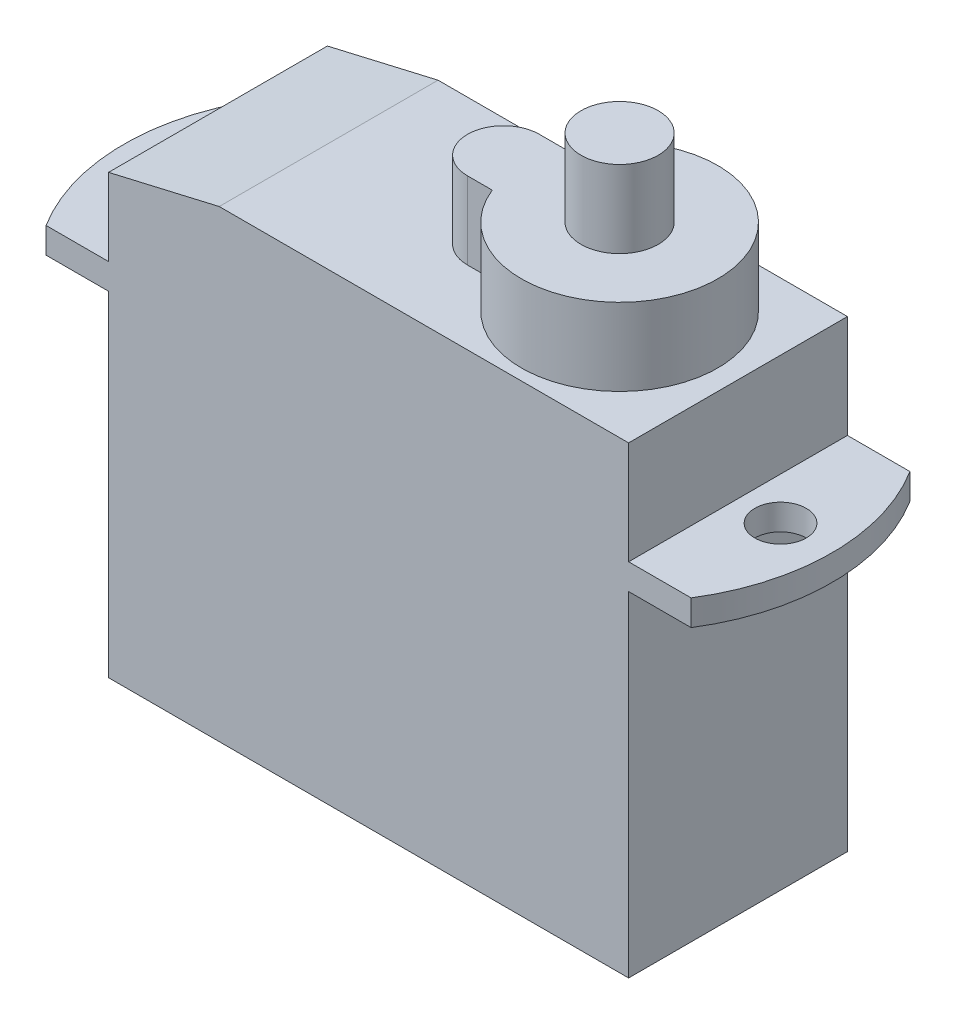
ISO-10303-21;
HEADER;
FILE_DESCRIPTION(('STEP AP214'),'2;1');
FILE_NAME('part.step','',(''),(''),'','','');
FILE_SCHEMA(('AUTOMOTIVE_DESIGN { 1 0 10303 214 1 1 1 1 }'));
ENDSEC;
DATA;
#1=APPLICATION_CONTEXT('core data for automotive mechanical design processes');
#2=APPLICATION_PROTOCOL_DEFINITION('international standard','automotive_design',2000,#1);
#3=PRODUCT_CONTEXT('',#1,'mechanical');
#4=PRODUCT('Part','Part','',(#3));
#5=PRODUCT_RELATED_PRODUCT_CATEGORY('part','',(#4));
#6=PRODUCT_DEFINITION_FORMATION('','',#4);
#7=PRODUCT_DEFINITION_CONTEXT('part definition',#1,'design');
#8=PRODUCT_DEFINITION('design','',#6,#7);
#9=PRODUCT_DEFINITION_SHAPE('','',#8);
#10=(LENGTH_UNIT() NAMED_UNIT(*) SI_UNIT(.MILLI.,.METRE.));
#11=(NAMED_UNIT(*) PLANE_ANGLE_UNIT() SI_UNIT($,.RADIAN.));
#12=(NAMED_UNIT(*) SI_UNIT($,.STERADIAN.) SOLID_ANGLE_UNIT());
#13=UNCERTAINTY_MEASURE_WITH_UNIT(LENGTH_MEASURE(1.E-05),#10,'distance_accuracy_value','');
#14=(GEOMETRIC_REPRESENTATION_CONTEXT(3) GLOBAL_UNCERTAINTY_ASSIGNED_CONTEXT((#13)) GLOBAL_UNIT_ASSIGNED_CONTEXT((#10,
#11,#12)) REPRESENTATION_CONTEXT('',''));
#15=CARTESIAN_POINT('',(0.,0.,0.));
#16=DIRECTION('',(0.,0.,1.));
#17=DIRECTION('',(1.,0.,0.));
#18=AXIS2_PLACEMENT_3D('',#15,#16,#17);
#19=CARTESIAN_POINT('',(5.5002938507475,24.,0.));
#20=DIRECTION('',(0.,1.,0.));
#21=DIRECTION('',(0.,0.,1.));
#22=AXIS2_PLACEMENT_3D('',#19,#20,#21);
#23=PLANE('',#22);
#24=CARTESIAN_POINT('',(5.5002938507475,24.,0.));
#25=DIRECTION('',(0.,-1.,0.));
#26=DIRECTION('',(0.,0.,-1.));
#27=AXIS2_PLACEMENT_3D('',#24,#25,#26);
#28=CIRCLE('',#27,1.5);
#29=CARTESIAN_POINT('',(5.5002938507475,24.,-1.5));
#30=VERTEX_POINT('',#29);
#31=EDGE_CURVE('E20',#30,#30,#28,.T.);
#32=ORIENTED_EDGE('',*,*,#31,.F.);
#33=EDGE_LOOP('',(#32));
#34=FACE_BOUND('',#33,.T.);
#35=ADVANCED_FACE('F17',(#34),#23,.T.);
#36=CARTESIAN_POINT('',(5.5002938507475,24.,0.));
#37=DIRECTION('',(0.,-1.,0.));
#38=DIRECTION('',(0.,0.,-1.));
#39=AXIS2_PLACEMENT_3D('',#36,#37,#38);
#40=CYLINDRICAL_SURFACE('',#39,1.5);
#41=CARTESIAN_POINT('',(5.5002938507475,21.,0.));
#42=DIRECTION('',(0.,-1.,0.));
#43=DIRECTION('',(0.,0.,-1.));
#44=AXIS2_PLACEMENT_3D('',#41,#42,#43);
#45=CIRCLE('',#44,1.5);
#46=CARTESIAN_POINT('',(5.5002938507475,21.,-1.5));
#47=VERTEX_POINT('',#46);
#48=EDGE_CURVE('E149',#47,#47,#45,.T.);
#49=ORIENTED_EDGE('',*,*,#48,.F.);
#50=EDGE_LOOP('',(#49));
#51=FACE_BOUND('',#50,.T.);
#52=ORIENTED_EDGE('',*,*,#31,.T.);
#53=EDGE_LOOP('',(#52));
#54=FACE_BOUND('',#53,.T.);
#55=ADVANCED_FACE('F230',(#51,#54),#40,.T.);
#56=CARTESIAN_POINT('',(0.988334051306182,21.,-1.3965589855414));
#57=DIRECTION('',(0.,0.,1.));
#58=DIRECTION('',(1.,0.,0.));
#59=AXIS2_PLACEMENT_3D('',#56,#57,#58);
#60=PLANE('',#59);
#61=DIRECTION('',(0.,-1.,0.));
#62=VECTOR('',#61,1.);
#63=CARTESIAN_POINT('',(0.988334051306182,21.,-1.3965589855414));
#64=LINE('',#63,#62);
#65=CARTESIAN_POINT('',(0.988334051306182,21.,-1.3965589855414));
#66=VERTEX_POINT('',#65);
#67=CARTESIAN_POINT('',(0.988334051306182,18.,-1.3965589855414));
#68=VERTEX_POINT('',#67);
#69=EDGE_CURVE('E156',#66,#68,#64,.T.);
#70=ORIENTED_EDGE('',*,*,#69,.F.);
#71=DIRECTION('',(1.,0.,0.));
#72=VECTOR('',#71,1.);
#73=CARTESIAN_POINT('',(0.988334051306182,21.,-1.3965589855414));
#74=LINE('',#73,#72);
#75=CARTESIAN_POINT('',(1.95030286475577,21.,-1.3965589855414));
#76=VERTEX_POINT('',#75);
#77=EDGE_CURVE('E140',#76,#66,#74,.F.);
#78=ORIENTED_EDGE('',*,*,#77,.F.);
#79=DIRECTION('',(0.,-1.,0.));
#80=VECTOR('',#79,1.);
#81=CARTESIAN_POINT('',(1.95030286475577,21.,-1.3965589855414));
#82=LINE('',#81,#80);
#83=CARTESIAN_POINT('',(1.95030286475577,18.,-1.3965589855414));
#84=VERTEX_POINT('',#83);
#85=EDGE_CURVE('E162',#84,#76,#82,.F.);
#86=ORIENTED_EDGE('',*,*,#85,.F.);
#87=DIRECTION('',(1.,0.,0.));
#88=VECTOR('',#87,1.);
#89=CARTESIAN_POINT('',(0.988334051306182,18.,-1.3965589855414));
#90=LINE('',#89,#88);
#91=EDGE_CURVE('E150',#68,#84,#90,.T.);
#92=ORIENTED_EDGE('',*,*,#91,.F.);
#93=EDGE_LOOP('',(#70,#78,#86,#92));
#94=FACE_BOUND('',#93,.T.);
#95=ADVANCED_FACE('F160',(#94),#60,.F.);
#96=CARTESIAN_POINT('',(0.988334051306182,21.,0.));
#97=DIRECTION('',(0.,1.,0.));
#98=DIRECTION('',(0.,0.,1.));
#99=AXIS2_PLACEMENT_3D('',#96,#97,#98);
#100=PLANE('',#99);
#101=ORIENTED_EDGE('',*,*,#48,.T.);
#102=EDGE_LOOP('',(#101));
#103=FACE_BOUND('',#102,.T.);
#104=CARTESIAN_POINT('',(5.5002938507475,21.,0.));
#105=DIRECTION('',(0.,-1.,0.));
#106=DIRECTION('',(0.,0.,-1.));
#107=AXIS2_PLACEMENT_3D('',#104,#105,#106);
#108=CIRCLE('',#107,3.81481493662785);
#109=CARTESIAN_POINT('',(1.95030286475577,21.,1.3965589855414));
#110=VERTEX_POINT('',#109);
#111=EDGE_CURVE('E144',#76,#110,#108,.T.);
#112=ORIENTED_EDGE('',*,*,#111,.F.);
#113=ORIENTED_EDGE('',*,*,#77,.T.);
#114=CARTESIAN_POINT('',(0.988334051306182,21.,0.));
#115=DIRECTION('',(0.,-1.,0.));
#116=DIRECTION('',(0.,0.,-1.));
#117=AXIS2_PLACEMENT_3D('',#114,#115,#116);
#118=CIRCLE('',#117,1.3965589855414);
#119=CARTESIAN_POINT('',(0.988334051306182,21.,1.3965589855414));
#120=VERTEX_POINT('',#119);
#121=EDGE_CURVE('E143',#120,#66,#118,.T.);
#122=ORIENTED_EDGE('',*,*,#121,.F.);
#123=DIRECTION('',(-1.,0.,0.));
#124=VECTOR('',#123,1.);
#125=CARTESIAN_POINT('',(0.988334051306182,21.,1.3965589855414));
#126=LINE('',#125,#124);
#127=EDGE_CURVE('E134',#120,#110,#126,.F.);
#128=ORIENTED_EDGE('',*,*,#127,.T.);
#129=EDGE_LOOP('',(#112,#113,#122,#128));
#130=FACE_BOUND('',#129,.T.);
#131=ADVANCED_FACE('F142',(#103,#130),#100,.T.);
#132=CARTESIAN_POINT('',(0.988334051306182,21.,1.3965589855414));
#133=DIRECTION('',(0.,0.,-1.));
#134=DIRECTION('',(-1.,0.,0.));
#135=AXIS2_PLACEMENT_3D('',#132,#133,#134);
#136=PLANE('',#135);
#137=DIRECTION('',(0.,-1.,0.));
#138=VECTOR('',#137,1.);
#139=CARTESIAN_POINT('',(1.95030286475577,21.,1.3965589855414));
#140=LINE('',#139,#138);
#141=CARTESIAN_POINT('',(1.95030286475577,18.,1.3965589855414));
#142=VERTEX_POINT('',#141);
#143=EDGE_CURVE('E225',#110,#142,#140,.T.);
#144=ORIENTED_EDGE('',*,*,#143,.F.);
#145=ORIENTED_EDGE('',*,*,#127,.F.);
#146=DIRECTION('',(0.,-1.,0.));
#147=VECTOR('',#146,1.);
#148=CARTESIAN_POINT('',(0.988334051306182,21.,1.3965589855414));
#149=LINE('',#148,#147);
#150=CARTESIAN_POINT('',(0.988334051306182,18.,1.3965589855414));
#151=VERTEX_POINT('',#150);
#152=EDGE_CURVE('E158',#151,#120,#149,.F.);
#153=ORIENTED_EDGE('',*,*,#152,.F.);
#154=DIRECTION('',(-1.,0.,0.));
#155=VECTOR('',#154,1.);
#156=CARTESIAN_POINT('',(0.988334051306182,18.,1.3965589855414));
#157=LINE('',#156,#155);
#158=EDGE_CURVE('E182',#142,#151,#157,.T.);
#159=ORIENTED_EDGE('',*,*,#158,.F.);
#160=EDGE_LOOP('',(#144,#145,#153,#159));
#161=FACE_BOUND('',#160,.T.);
#162=ADVANCED_FACE('F316',(#161),#136,.F.);
#163=CARTESIAN_POINT('',(-5.75,14.,0.));
#164=DIRECTION('',(0.,-1.,0.));
#165=DIRECTION('',(0.,0.,-1.));
#166=AXIS2_PLACEMENT_3D('',#163,#164,#165);
#167=CYLINDRICAL_SURFACE('',#166,8.);
#168=CARTESIAN_POINT('',(-5.75,14.,0.));
#169=DIRECTION('',(0.,-1.,0.));
#170=DIRECTION('',(0.,0.,-1.));
#171=AXIS2_PLACEMENT_3D('',#168,#169,#170);
#172=CIRCLE('',#171,8.);
#173=CARTESIAN_POINT('',(-12.527720855863,14.,-4.25));
#174=VERTEX_POINT('',#173);
#175=CARTESIAN_POINT('',(-12.527720855863,14.,4.25000000000001));
#176=VERTEX_POINT('',#175);
#177=EDGE_CURVE('E214',#174,#176,#172,.F.);
#178=ORIENTED_EDGE('',*,*,#177,.F.);
#179=DIRECTION('',(0.,1.,0.));
#180=VECTOR('',#179,1.);
#181=CARTESIAN_POINT('',(-12.527720855863,13.,-4.25));
#182=LINE('',#181,#180);
#183=CARTESIAN_POINT('',(-12.527720855863,13.,-4.25));
#184=VERTEX_POINT('',#183);
#185=EDGE_CURVE('E183',#174,#184,#182,.F.);
#186=ORIENTED_EDGE('',*,*,#185,.T.);
#187=CARTESIAN_POINT('',(-5.75,13.,0.));
#188=DIRECTION('',(0.,-1.,0.));
#189=DIRECTION('',(0.,0.,-1.));
#190=AXIS2_PLACEMENT_3D('',#187,#188,#189);
#191=CIRCLE('',#190,8.);
#192=CARTESIAN_POINT('',(-12.527720855863,13.,4.25000000000001));
#193=VERTEX_POINT('',#192);
#194=EDGE_CURVE('E218',#184,#193,#191,.F.);
#195=ORIENTED_EDGE('',*,*,#194,.T.);
#196=DIRECTION('',(0.,-1.,0.));
#197=VECTOR('',#196,1.);
#198=CARTESIAN_POINT('',(-12.527720855863,14.,4.25000000000001));
#199=LINE('',#198,#197);
#200=EDGE_CURVE('E168',#193,#176,#199,.F.);
#201=ORIENTED_EDGE('',*,*,#200,.T.);
#202=EDGE_LOOP('',(#178,#186,#195,#201));
#203=FACE_BOUND('',#202,.T.);
#204=ADVANCED_FACE('F312',(#203),#167,.T.);
#205=CARTESIAN_POINT('',(-11.75,14.,0.));
#206=DIRECTION('',(0.,-1.,0.));
#207=DIRECTION('',(0.,0.,-1.));
#208=AXIS2_PLACEMENT_3D('',#205,#206,#207);
#209=CYLINDRICAL_SURFACE('',#208,1.);
#210=CARTESIAN_POINT('',(-11.75,14.,0.));
#211=DIRECTION('',(0.,-1.,0.));
#212=DIRECTION('',(0.,0.,-1.));
#213=AXIS2_PLACEMENT_3D('',#210,#211,#212);
#214=CIRCLE('',#213,1.);
#215=CARTESIAN_POINT('',(-11.75,14.,-1.));
#216=VERTEX_POINT('',#215);
#217=EDGE_CURVE('E178',#216,#216,#214,.T.);
#218=ORIENTED_EDGE('',*,*,#217,.F.);
#219=EDGE_LOOP('',(#218));
#220=FACE_BOUND('',#219,.T.);
#221=CARTESIAN_POINT('',(-11.75,13.,0.));
#222=DIRECTION('',(0.,-1.,0.));
#223=DIRECTION('',(0.,0.,-1.));
#224=AXIS2_PLACEMENT_3D('',#221,#222,#223);
#225=CIRCLE('',#224,1.);
#226=CARTESIAN_POINT('',(-11.75,13.,-1.));
#227=VERTEX_POINT('',#226);
#228=EDGE_CURVE('E222',#227,#227,#225,.T.);
#229=ORIENTED_EDGE('',*,*,#228,.T.);
#230=EDGE_LOOP('',(#229));
#231=FACE_BOUND('',#230,.T.);
#232=ADVANCED_FACE('F309',(#220,#231),#209,.F.);
#233=CARTESIAN_POINT('',(0.988334051306182,21.,0.));
#234=DIRECTION('',(0.,-1.,0.));
#235=DIRECTION('',(0.,0.,-1.));
#236=AXIS2_PLACEMENT_3D('',#233,#234,#235);
#237=CYLINDRICAL_SURFACE('',#236,1.3965589855414);
#238=ORIENTED_EDGE('',*,*,#121,.T.);
#239=ORIENTED_EDGE('',*,*,#69,.T.);
#240=CARTESIAN_POINT('',(0.988334051306182,18.,0.));
#241=DIRECTION('',(0.,-1.,0.));
#242=DIRECTION('',(0.,0.,-1.));
#243=AXIS2_PLACEMENT_3D('',#240,#241,#242);
#244=CIRCLE('',#243,1.3965589855414);
#245=EDGE_CURVE('E209',#151,#68,#244,.T.);
#246=ORIENTED_EDGE('',*,*,#245,.F.);
#247=ORIENTED_EDGE('',*,*,#152,.T.);
#248=EDGE_LOOP('',(#238,#239,#246,#247));
#249=FACE_BOUND('',#248,.T.);
#250=ADVANCED_FACE('F154',(#249),#237,.T.);
#251=CARTESIAN_POINT('',(5.5002938507475,21.,0.));
#252=DIRECTION('',(0.,-1.,0.));
#253=DIRECTION('',(0.,0.,-1.));
#254=AXIS2_PLACEMENT_3D('',#251,#252,#253);
#255=CYLINDRICAL_SURFACE('',#254,3.81481493662785);
#256=ORIENTED_EDGE('',*,*,#143,.T.);
#257=CARTESIAN_POINT('',(5.5002938507475,18.,0.));
#258=DIRECTION('',(0.,-1.,0.));
#259=DIRECTION('',(0.,0.,-1.));
#260=AXIS2_PLACEMENT_3D('',#257,#258,#259);
#261=CIRCLE('',#260,3.81481493662785);
#262=EDGE_CURVE('E205',#84,#142,#261,.T.);
#263=ORIENTED_EDGE('',*,*,#262,.F.);
#264=ORIENTED_EDGE('',*,*,#85,.T.);
#265=ORIENTED_EDGE('',*,*,#111,.T.);
#266=EDGE_LOOP('',(#256,#263,#264,#265));
#267=FACE_BOUND('',#266,.T.);
#268=ADVANCED_FACE('F302',(#267),#255,.T.);
#269=CARTESIAN_POINT('',(11.75,14.,0.));
#270=DIRECTION('',(0.,-1.,0.));
#271=DIRECTION('',(0.,0.,-1.));
#272=AXIS2_PLACEMENT_3D('',#269,#270,#271);
#273=CYLINDRICAL_SURFACE('',#272,1.);
#274=CARTESIAN_POINT('',(11.75,13.,0.));
#275=DIRECTION('',(0.,-1.,0.));
#276=DIRECTION('',(0.,0.,-1.));
#277=AXIS2_PLACEMENT_3D('',#274,#275,#276);
#278=CIRCLE('',#277,1.);
#279=CARTESIAN_POINT('',(11.75,13.,-1.));
#280=VERTEX_POINT('',#279);
#281=EDGE_CURVE('E195',#280,#280,#278,.T.);
#282=ORIENTED_EDGE('',*,*,#281,.T.);
#283=EDGE_LOOP('',(#282));
#284=FACE_BOUND('',#283,.T.);
#285=CARTESIAN_POINT('',(11.75,14.,0.));
#286=DIRECTION('',(0.,-1.,0.));
#287=DIRECTION('',(0.,0.,-1.));
#288=AXIS2_PLACEMENT_3D('',#285,#286,#287);
#289=CIRCLE('',#288,1.);
#290=CARTESIAN_POINT('',(11.75,14.,-1.));
#291=VERTEX_POINT('',#290);
#292=EDGE_CURVE('E198',#291,#291,#289,.T.);
#293=ORIENTED_EDGE('',*,*,#292,.F.);
#294=EDGE_LOOP('',(#293));
#295=FACE_BOUND('',#294,.T.);
#296=ADVANCED_FACE('F298',(#284,#295),#273,.F.);
#297=CARTESIAN_POINT('',(5.75,14.,0.));
#298=DIRECTION('',(0.,-1.,0.));
#299=DIRECTION('',(0.,0.,-1.));
#300=AXIS2_PLACEMENT_3D('',#297,#298,#299);
#301=CYLINDRICAL_SURFACE('',#300,8.);
#302=CARTESIAN_POINT('',(5.75,14.,0.));
#303=DIRECTION('',(0.,-1.,0.));
#304=DIRECTION('',(0.,0.,-1.));
#305=AXIS2_PLACEMENT_3D('',#302,#303,#304);
#306=CIRCLE('',#305,8.);
#307=CARTESIAN_POINT('',(12.527720855863,14.,4.25));
#308=VERTEX_POINT('',#307);
#309=CARTESIAN_POINT('',(12.527720855863,14.,-4.24999999999999));
#310=VERTEX_POINT('',#309);
#311=EDGE_CURVE('E202',#308,#310,#306,.F.);
#312=ORIENTED_EDGE('',*,*,#311,.F.);
#313=DIRECTION('',(0.,-1.,0.));
#314=VECTOR('',#313,1.);
#315=CARTESIAN_POINT('',(12.527720855863,14.,4.25));
#316=LINE('',#315,#314);
#317=CARTESIAN_POINT('',(12.527720855863,13.,4.25));
#318=VERTEX_POINT('',#317);
#319=EDGE_CURVE('E471',#308,#318,#316,.T.);
#320=ORIENTED_EDGE('',*,*,#319,.T.);
#321=CARTESIAN_POINT('',(5.75,13.,0.));
#322=DIRECTION('',(0.,-1.,0.));
#323=DIRECTION('',(0.,0.,-1.));
#324=AXIS2_PLACEMENT_3D('',#321,#322,#323);
#325=CIRCLE('',#324,8.);
#326=CARTESIAN_POINT('',(12.527720855863,13.,-4.24999999999999));
#327=VERTEX_POINT('',#326);
#328=EDGE_CURVE('E191',#318,#327,#325,.F.);
#329=ORIENTED_EDGE('',*,*,#328,.T.);
#330=DIRECTION('',(0.,1.,0.));
#331=VECTOR('',#330,1.);
#332=CARTESIAN_POINT('',(12.527720855863,13.,-4.25));
#333=LINE('',#332,#331);
#334=EDGE_CURVE('E187',#327,#310,#333,.T.);
#335=ORIENTED_EDGE('',*,*,#334,.T.);
#336=EDGE_LOOP('',(#312,#320,#329,#335));
#337=FACE_BOUND('',#336,.T.);
#338=ADVANCED_FACE('F294',(#337),#301,.T.);
#339=CARTESIAN_POINT('',(-10.1,13.,-4.25));
#340=DIRECTION('',(0.,0.,1.));
#341=DIRECTION('',(1.,0.,0.));
#342=AXIS2_PLACEMENT_3D('',#339,#340,#341);
#343=PLANE('',#342);
#344=DIRECTION('',(0.,1.,0.));
#345=VECTOR('',#344,1.);
#346=CARTESIAN_POINT('',(-10.1,13.,-4.25));
#347=LINE('',#346,#345);
#348=CARTESIAN_POINT('',(-10.1,0.,-4.25));
#349=VERTEX_POINT('',#348);
#350=CARTESIAN_POINT('',(-10.1,13.,-4.25));
#351=VERTEX_POINT('',#350);
#352=EDGE_CURVE('E186',#349,#351,#347,.T.);
#353=ORIENTED_EDGE('',*,*,#352,.T.);
#354=DIRECTION('',(1.,0.,0.));
#355=VECTOR('',#354,1.);
#356=CARTESIAN_POINT('',(-5.75,13.,-4.25));
#357=LINE('',#356,#355);
#358=EDGE_CURVE('E513',#351,#184,#357,.F.);
#359=ORIENTED_EDGE('',*,*,#358,.T.);
#360=ORIENTED_EDGE('',*,*,#185,.F.);
#361=DIRECTION('',(1.,0.,0.));
#362=VECTOR('',#361,1.);
#363=CARTESIAN_POINT('',(-5.75,14.,-4.25));
#364=LINE('',#363,#362);
#365=CARTESIAN_POINT('',(-10.1,14.,-4.25));
#366=VERTEX_POINT('',#365);
#367=EDGE_CURVE('E217',#366,#174,#364,.F.);
#368=ORIENTED_EDGE('',*,*,#367,.F.);
#369=DIRECTION('',(0.,1.,0.));
#370=VECTOR('',#369,1.);
#371=CARTESIAN_POINT('',(-10.1,17.,-4.25));
#372=LINE('',#371,#370);
#373=CARTESIAN_POINT('',(-10.1,17.,-4.25));
#374=VERTEX_POINT('',#373);
#375=EDGE_CURVE('E175',#366,#374,#372,.T.);
#376=ORIENTED_EDGE('',*,*,#375,.T.);
#377=DIRECTION('',(-0.973995340832267,-0.226568038427833,0.));
#378=VECTOR('',#377,1.);
#379=CARTESIAN_POINT('',(-10.1,17.,-4.25));
#380=LINE('',#379,#378);
#381=CARTESIAN_POINT('',(-5.80109117071026,18.,-4.25));
#382=VERTEX_POINT('',#381);
#383=EDGE_CURVE('E169',#382,#374,#380,.T.);
#384=ORIENTED_EDGE('',*,*,#383,.F.);
#385=DIRECTION('',(1.,0.,0.));
#386=VECTOR('',#385,1.);
#387=CARTESIAN_POINT('',(-5.80109117071026,18.,-4.25));
#388=LINE('',#387,#386);
#389=CARTESIAN_POINT('',(10.1,18.,-4.25));
#390=VERTEX_POINT('',#389);
#391=EDGE_CURVE('E476',#390,#382,#388,.F.);
#392=ORIENTED_EDGE('',*,*,#391,.F.);
#393=DIRECTION('',(0.,1.,0.));
#394=VECTOR('',#393,1.);
#395=CARTESIAN_POINT('',(10.1,17.,-4.25));
#396=LINE('',#395,#394);
#397=CARTESIAN_POINT('',(10.1,14.,-4.24999999999999));
#398=VERTEX_POINT('',#397);
#399=EDGE_CURVE('E480',#390,#398,#396,.F.);
#400=ORIENTED_EDGE('',*,*,#399,.T.);
#401=DIRECTION('',(1.,0.,0.));
#402=VECTOR('',#401,1.);
#403=CARTESIAN_POINT('',(-5.75,14.,-4.24999999999999));
#404=LINE('',#403,#402);
#405=EDGE_CURVE('E201',#310,#398,#404,.F.);
#406=ORIENTED_EDGE('',*,*,#405,.F.);
#407=ORIENTED_EDGE('',*,*,#334,.F.);
#408=DIRECTION('',(1.,0.,0.));
#409=VECTOR('',#408,1.);
#410=CARTESIAN_POINT('',(-5.75,13.,-4.24999999999999));
#411=LINE('',#410,#409);
#412=CARTESIAN_POINT('',(10.1,13.,-4.25));
#413=VERTEX_POINT('',#412);
#414=EDGE_CURVE('E194',#327,#413,#411,.F.);
#415=ORIENTED_EDGE('',*,*,#414,.T.);
#416=DIRECTION('',(0.,1.,0.));
#417=VECTOR('',#416,1.);
#418=CARTESIAN_POINT('',(10.1,13.,-4.25));
#419=LINE('',#418,#417);
#420=CARTESIAN_POINT('',(10.1,0.,-4.25));
#421=VERTEX_POINT('',#420);
#422=EDGE_CURVE('E486',#413,#421,#419,.F.);
#423=ORIENTED_EDGE('',*,*,#422,.T.);
#424=DIRECTION('',(1.,0.,0.));
#425=VECTOR('',#424,1.);
#426=CARTESIAN_POINT('',(0.,0.,-4.25));
#427=LINE('',#426,#425);
#428=EDGE_CURVE('E491',#349,#421,#427,.T.);
#429=ORIENTED_EDGE('',*,*,#428,.F.);
#430=EDGE_LOOP('',(#353,#359,#360,#368,#376,#384,#392,#400,#406,#407,#415,#423,#429));
#431=FACE_BOUND('',#430,.T.);
#432=ADVANCED_FACE('F290',(#431),#343,.F.);
#433=CARTESIAN_POINT('',(-10.1,13.,4.25));
#434=DIRECTION('',(1.,0.,0.));
#435=DIRECTION('',(0.,0.,-1.));
#436=AXIS2_PLACEMENT_3D('',#433,#434,#435);
#437=PLANE('',#436);
#438=DIRECTION('',(0.,1.,0.));
#439=VECTOR('',#438,1.);
#440=CARTESIAN_POINT('',(-10.1,13.,4.25));
#441=LINE('',#440,#439);
#442=CARTESIAN_POINT('',(-10.1,0.,4.25));
#443=VERTEX_POINT('',#442);
#444=CARTESIAN_POINT('',(-10.1,13.,4.25));
#445=VERTEX_POINT('',#444);
#446=EDGE_CURVE('E493',#443,#445,#441,.T.);
#447=ORIENTED_EDGE('',*,*,#446,.T.);
#448=DIRECTION('',(0.,0.,1.));
#449=VECTOR('',#448,1.);
#450=CARTESIAN_POINT('',(-10.1,13.,0.));
#451=LINE('',#450,#449);
#452=EDGE_CURVE('E221',#445,#351,#451,.F.);
#453=ORIENTED_EDGE('',*,*,#452,.T.);
#454=ORIENTED_EDGE('',*,*,#352,.F.);
#455=DIRECTION('',(0.,0.,-1.));
#456=VECTOR('',#455,1.);
#457=CARTESIAN_POINT('',(-10.1,0.,0.));
#458=LINE('',#457,#456);
#459=EDGE_CURVE('E494',#443,#349,#458,.T.);
#460=ORIENTED_EDGE('',*,*,#459,.F.);
#461=EDGE_LOOP('',(#447,#453,#454,#460));
#462=FACE_BOUND('',#461,.T.);
#463=ADVANCED_FACE('F286',(#462),#437,.F.);
#464=CARTESIAN_POINT('',(-5.75,13.,0.));
#465=DIRECTION('',(0.,1.,0.));
#466=DIRECTION('',(0.,0.,1.));
#467=AXIS2_PLACEMENT_3D('',#464,#465,#466);
#468=PLANE('',#467);
#469=ORIENTED_EDGE('',*,*,#452,.F.);
#470=DIRECTION('',(-1.,0.,0.));
#471=VECTOR('',#470,1.);
#472=CARTESIAN_POINT('',(-10.1,13.,4.25));
#473=LINE('',#472,#471);
#474=EDGE_CURVE('E508',#445,#193,#473,.T.);
#475=ORIENTED_EDGE('',*,*,#474,.T.);
#476=ORIENTED_EDGE('',*,*,#194,.F.);
#477=ORIENTED_EDGE('',*,*,#358,.F.);
#478=EDGE_LOOP('',(#469,#475,#476,#477));
#479=FACE_BOUND('',#478,.T.);
#480=ORIENTED_EDGE('',*,*,#228,.F.);
#481=EDGE_LOOP('',(#480));
#482=FACE_BOUND('',#481,.T.);
#483=ADVANCED_FACE('F282',(#479,#482),#468,.F.);
#484=CARTESIAN_POINT('',(-5.75,14.,0.));
#485=DIRECTION('',(0.,1.,0.));
#486=DIRECTION('',(0.,0.,1.));
#487=AXIS2_PLACEMENT_3D('',#484,#485,#486);
#488=PLANE('',#487);
#489=ORIENTED_EDGE('',*,*,#217,.T.);
#490=EDGE_LOOP('',(#489));
#491=FACE_BOUND('',#490,.T.);
#492=ORIENTED_EDGE('',*,*,#177,.T.);
#493=DIRECTION('',(-1.,0.,0.));
#494=VECTOR('',#493,1.);
#495=CARTESIAN_POINT('',(-10.1,14.,4.25));
#496=LINE('',#495,#494);
#497=CARTESIAN_POINT('',(-10.1,14.,4.25));
#498=VERTEX_POINT('',#497);
#499=EDGE_CURVE('E518',#176,#498,#496,.F.);
#500=ORIENTED_EDGE('',*,*,#499,.T.);
#501=DIRECTION('',(0.,0.,-1.));
#502=VECTOR('',#501,1.);
#503=CARTESIAN_POINT('',(-10.1,14.,-4.25));
#504=LINE('',#503,#502);
#505=EDGE_CURVE('E172',#498,#366,#504,.T.);
#506=ORIENTED_EDGE('',*,*,#505,.T.);
#507=ORIENTED_EDGE('',*,*,#367,.T.);
#508=EDGE_LOOP('',(#492,#500,#506,#507));
#509=FACE_BOUND('',#508,.T.);
#510=ADVANCED_FACE('F278',(#491,#509),#488,.T.);
#511=CARTESIAN_POINT('',(-10.1,17.,-4.25));
#512=DIRECTION('',(1.,0.,0.));
#513=DIRECTION('',(0.,0.,-1.));
#514=AXIS2_PLACEMENT_3D('',#511,#512,#513);
#515=PLANE('',#514);
#516=DIRECTION('',(0.,1.,0.));
#517=VECTOR('',#516,1.);
#518=CARTESIAN_POINT('',(-10.1,13.,4.25));
#519=LINE('',#518,#517);
#520=CARTESIAN_POINT('',(-10.1,17.,4.25));
#521=VERTEX_POINT('',#520);
#522=EDGE_CURVE('E531',#498,#521,#519,.T.);
#523=ORIENTED_EDGE('',*,*,#522,.T.);
#524=DIRECTION('',(0.,0.,1.));
#525=VECTOR('',#524,1.);
#526=CARTESIAN_POINT('',(-10.1,17.,-24.4747373283314));
#527=LINE('',#526,#525);
#528=EDGE_CURVE('E171',#374,#521,#527,.T.);
#529=ORIENTED_EDGE('',*,*,#528,.F.);
#530=ORIENTED_EDGE('',*,*,#375,.F.);
#531=ORIENTED_EDGE('',*,*,#505,.F.);
#532=EDGE_LOOP('',(#523,#529,#530,#531));
#533=FACE_BOUND('',#532,.T.);
#534=ADVANCED_FACE('F274',(#533),#515,.F.);
#535=CARTESIAN_POINT('',(-10.1,17.,-24.4747373283314));
#536=DIRECTION('',(-0.226568038427833,0.973995340832267,0.));
#537=DIRECTION('',(-0.973995340832267,-0.226568038427833,0.));
#538=AXIS2_PLACEMENT_3D('',#535,#536,#537);
#539=PLANE('',#538);
#540=DIRECTION('',(0.973995340832267,0.226568038427834,0.));
#541=VECTOR('',#540,1.);
#542=CARTESIAN_POINT('',(-10.1,17.,4.25));
#543=LINE('',#542,#541);
#544=CARTESIAN_POINT('',(-5.80109117071026,18.,4.25));
#545=VERTEX_POINT('',#544);
#546=EDGE_CURVE('E540',#521,#545,#543,.T.);
#547=ORIENTED_EDGE('',*,*,#546,.T.);
#548=DIRECTION('',(0.,0.,1.));
#549=VECTOR('',#548,1.);
#550=CARTESIAN_POINT('',(-5.80109117071026,18.,-24.4747373283314));
#551=LINE('',#550,#549);
#552=EDGE_CURVE('E211',#382,#545,#551,.T.);
#553=ORIENTED_EDGE('',*,*,#552,.F.);
#554=ORIENTED_EDGE('',*,*,#383,.T.);
#555=ORIENTED_EDGE('',*,*,#528,.T.);
#556=EDGE_LOOP('',(#547,#553,#554,#555));
#557=FACE_BOUND('',#556,.T.);
#558=ADVANCED_FACE('F270',(#557),#539,.T.);
#559=CARTESIAN_POINT('',(-5.80109117071026,18.,-24.4747373283314));
#560=DIRECTION('',(0.,1.,0.));
#561=DIRECTION('',(0.,0.,1.));
#562=AXIS2_PLACEMENT_3D('',#559,#560,#561);
#563=PLANE('',#562);
#564=ORIENTED_EDGE('',*,*,#91,.T.);
#565=ORIENTED_EDGE('',*,*,#262,.T.);
#566=ORIENTED_EDGE('',*,*,#158,.T.);
#567=ORIENTED_EDGE('',*,*,#245,.T.);
#568=EDGE_LOOP('',(#564,#565,#566,#567));
#569=FACE_BOUND('',#568,.T.);
#570=DIRECTION('',(-1.,0.,0.));
#571=VECTOR('',#570,1.);
#572=CARTESIAN_POINT('',(-10.1,18.,4.25));
#573=LINE('',#572,#571);
#574=CARTESIAN_POINT('',(10.1,18.,4.25));
#575=VERTEX_POINT('',#574);
#576=EDGE_CURVE('E548',#545,#575,#573,.F.);
#577=ORIENTED_EDGE('',*,*,#576,.T.);
#578=DIRECTION('',(0.,0.,1.));
#579=VECTOR('',#578,1.);
#580=CARTESIAN_POINT('',(10.1,18.,-4.25));
#581=LINE('',#580,#579);
#582=EDGE_CURVE('E208',#575,#390,#581,.F.);
#583=ORIENTED_EDGE('',*,*,#582,.T.);
#584=ORIENTED_EDGE('',*,*,#391,.T.);
#585=ORIENTED_EDGE('',*,*,#552,.T.);
#586=EDGE_LOOP('',(#577,#583,#584,#585));
#587=FACE_BOUND('',#586,.T.);
#588=ADVANCED_FACE('F266',(#569,#587),#563,.T.);
#589=CARTESIAN_POINT('',(10.1,17.,-4.25));
#590=DIRECTION('',(-1.,0.,0.));
#591=DIRECTION('',(0.,0.,1.));
#592=AXIS2_PLACEMENT_3D('',#589,#590,#591);
#593=PLANE('',#592);
#594=ORIENTED_EDGE('',*,*,#399,.F.);
#595=ORIENTED_EDGE('',*,*,#582,.F.);
#596=DIRECTION('',(0.,1.,0.));
#597=VECTOR('',#596,1.);
#598=CARTESIAN_POINT('',(10.1,13.,4.25));
#599=LINE('',#598,#597);
#600=CARTESIAN_POINT('',(10.1,14.,4.25));
#601=VERTEX_POINT('',#600);
#602=EDGE_CURVE('E556',#575,#601,#599,.F.);
#603=ORIENTED_EDGE('',*,*,#602,.T.);
#604=DIRECTION('',(0.,0.,1.));
#605=VECTOR('',#604,1.);
#606=CARTESIAN_POINT('',(10.1,14.,0.));
#607=LINE('',#606,#605);
#608=EDGE_CURVE('E204',#398,#601,#607,.T.);
#609=ORIENTED_EDGE('',*,*,#608,.F.);
#610=EDGE_LOOP('',(#594,#595,#603,#609));
#611=FACE_BOUND('',#610,.T.);
#612=ADVANCED_FACE('F262',(#611),#593,.F.);
#613=CARTESIAN_POINT('',(-5.75,14.,0.));
#614=DIRECTION('',(0.,1.,0.));
#615=DIRECTION('',(0.,0.,1.));
#616=AXIS2_PLACEMENT_3D('',#613,#614,#615);
#617=PLANE('',#616);
#618=ORIENTED_EDGE('',*,*,#292,.T.);
#619=EDGE_LOOP('',(#618));
#620=FACE_BOUND('',#619,.T.);
#621=ORIENTED_EDGE('',*,*,#311,.T.);
#622=ORIENTED_EDGE('',*,*,#405,.T.);
#623=ORIENTED_EDGE('',*,*,#608,.T.);
#624=DIRECTION('',(-1.,0.,0.));
#625=VECTOR('',#624,1.);
#626=CARTESIAN_POINT('',(-10.1,14.,4.25));
#627=LINE('',#626,#625);
#628=EDGE_CURVE('E565',#601,#308,#627,.F.);
#629=ORIENTED_EDGE('',*,*,#628,.T.);
#630=EDGE_LOOP('',(#621,#622,#623,#629));
#631=FACE_BOUND('',#630,.T.);
#632=ADVANCED_FACE('F258',(#620,#631),#617,.T.);
#633=CARTESIAN_POINT('',(-5.75,13.,0.));
#634=DIRECTION('',(0.,1.,0.));
#635=DIRECTION('',(0.,0.,1.));
#636=AXIS2_PLACEMENT_3D('',#633,#634,#635);
#637=PLANE('',#636);
#638=DIRECTION('',(0.,0.,1.));
#639=VECTOR('',#638,1.);
#640=CARTESIAN_POINT('',(10.1,13.,4.25));
#641=LINE('',#640,#639);
#642=CARTESIAN_POINT('',(10.1,13.,4.25));
#643=VERTEX_POINT('',#642);
#644=EDGE_CURVE('E488',#643,#413,#641,.F.);
#645=ORIENTED_EDGE('',*,*,#644,.T.);
#646=ORIENTED_EDGE('',*,*,#414,.F.);
#647=ORIENTED_EDGE('',*,*,#328,.F.);
#648=DIRECTION('',(-1.,0.,0.));
#649=VECTOR('',#648,1.);
#650=CARTESIAN_POINT('',(-10.1,13.,4.25));
#651=LINE('',#650,#649);
#652=EDGE_CURVE('E573',#318,#643,#651,.T.);
#653=ORIENTED_EDGE('',*,*,#652,.T.);
#654=EDGE_LOOP('',(#645,#646,#647,#653));
#655=FACE_BOUND('',#654,.T.);
#656=ORIENTED_EDGE('',*,*,#281,.F.);
#657=EDGE_LOOP('',(#656));
#658=FACE_BOUND('',#657,.T.);
#659=ADVANCED_FACE('F254',(#655,#658),#637,.F.);
#660=CARTESIAN_POINT('',(10.1,13.,4.25));
#661=DIRECTION('',(-1.,0.,0.));
#662=DIRECTION('',(0.,0.,1.));
#663=AXIS2_PLACEMENT_3D('',#660,#661,#662);
#664=PLANE('',#663);
#665=ORIENTED_EDGE('',*,*,#422,.F.);
#666=ORIENTED_EDGE('',*,*,#644,.F.);
#667=DIRECTION('',(0.,1.,0.));
#668=VECTOR('',#667,1.);
#669=CARTESIAN_POINT('',(10.1,13.,4.25));
#670=LINE('',#669,#668);
#671=CARTESIAN_POINT('',(10.1,0.,4.25));
#672=VERTEX_POINT('',#671);
#673=EDGE_CURVE('E26',#643,#672,#670,.F.);
#674=ORIENTED_EDGE('',*,*,#673,.T.);
#675=DIRECTION('',(0.,0.,-1.));
#676=VECTOR('',#675,1.);
#677=CARTESIAN_POINT('',(10.1,0.,0.));
#678=LINE('',#677,#676);
#679=EDGE_CURVE('E34',#421,#672,#678,.F.);
#680=ORIENTED_EDGE('',*,*,#679,.F.);
#681=EDGE_LOOP('',(#665,#666,#674,#680));
#682=FACE_BOUND('',#681,.T.);
#683=ADVANCED_FACE('F248',(#682),#664,.F.);
#684=CARTESIAN_POINT('',(0.,0.,0.));
#685=DIRECTION('',(0.,-1.,0.));
#686=DIRECTION('',(0.,0.,-1.));
#687=AXIS2_PLACEMENT_3D('',#684,#685,#686);
#688=PLANE('',#687);
#689=ORIENTED_EDGE('',*,*,#459,.T.);
#690=ORIENTED_EDGE('',*,*,#428,.T.);
#691=ORIENTED_EDGE('',*,*,#679,.T.);
#692=DIRECTION('',(-1.,0.,0.));
#693=VECTOR('',#692,1.);
#694=CARTESIAN_POINT('',(-10.1,0.,4.25));
#695=LINE('',#694,#693);
#696=EDGE_CURVE('E11',#672,#443,#695,.T.);
#697=ORIENTED_EDGE('',*,*,#696,.T.);
#698=EDGE_LOOP('',(#689,#690,#691,#697));
#699=FACE_BOUND('',#698,.T.);
#700=ADVANCED_FACE('F242',(#699),#688,.T.);
#701=CARTESIAN_POINT('',(-10.1,13.,4.25));
#702=DIRECTION('',(0.,0.,-1.));
#703=DIRECTION('',(-1.,0.,0.));
#704=AXIS2_PLACEMENT_3D('',#701,#702,#703);
#705=PLANE('',#704);
#706=ORIENTED_EDGE('',*,*,#673,.F.);
#707=ORIENTED_EDGE('',*,*,#652,.F.);
#708=ORIENTED_EDGE('',*,*,#319,.F.);
#709=ORIENTED_EDGE('',*,*,#628,.F.);
#710=ORIENTED_EDGE('',*,*,#602,.F.);
#711=ORIENTED_EDGE('',*,*,#576,.F.);
#712=ORIENTED_EDGE('',*,*,#546,.F.);
#713=ORIENTED_EDGE('',*,*,#522,.F.);
#714=ORIENTED_EDGE('',*,*,#499,.F.);
#715=ORIENTED_EDGE('',*,*,#200,.F.);
#716=ORIENTED_EDGE('',*,*,#474,.F.);
#717=ORIENTED_EDGE('',*,*,#446,.F.);
#718=ORIENTED_EDGE('',*,*,#696,.F.);
#719=EDGE_LOOP('',(#706,#707,#708,#709,#710,#711,#712,#713,#714,#715,#716,#717,#718));
#720=FACE_BOUND('',#719,.T.);
#721=ADVANCED_FACE('F240',(#720),#705,.F.);
#722=CLOSED_SHELL('',(#35,#55,#95,#131,#162,#204,#232,#250,#268,#296,#338,#432,#463,#483,#510,
#534,#558,#588,#612,#632,#659,#683,#700,#721));
#723=MANIFOLD_SOLID_BREP('B1',#722);
#724=ADVANCED_BREP_SHAPE_REPRESENTATION('',(#18,#723),#14);
#725=SHAPE_DEFINITION_REPRESENTATION(#9,#724);
ENDSEC;
END-ISO-10303-21;
